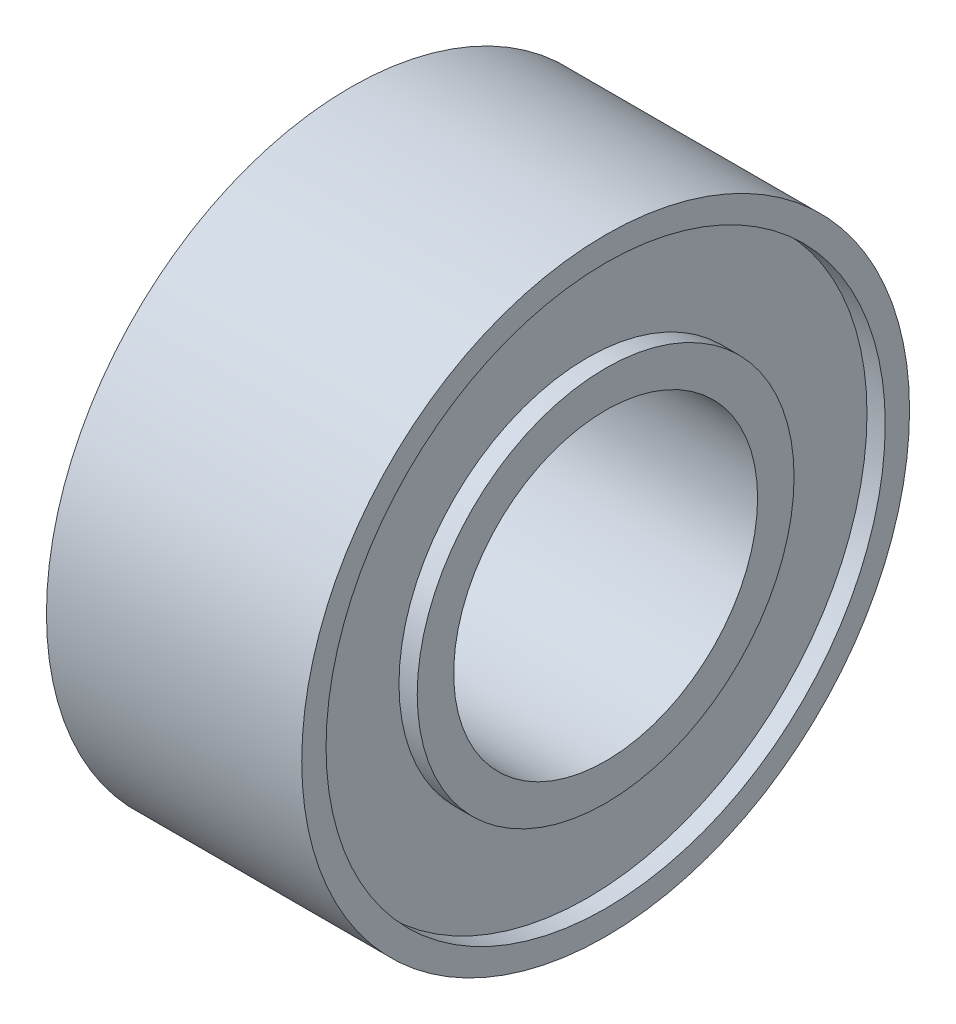
ISO-10303-21;
HEADER;
FILE_DESCRIPTION(('STEP AP214'),'2;1');
FILE_NAME('part.step','',(''),(''),'','','');
FILE_SCHEMA(('AUTOMOTIVE_DESIGN { 1 0 10303 214 1 1 1 1 }'));
ENDSEC;
DATA;
#1=APPLICATION_CONTEXT('core data for automotive mechanical design processes');
#2=APPLICATION_PROTOCOL_DEFINITION('international standard','automotive_design',2000,#1);
#3=PRODUCT_CONTEXT('',#1,'mechanical');
#4=PRODUCT('Part','Part','',(#3));
#5=PRODUCT_RELATED_PRODUCT_CATEGORY('part','',(#4));
#6=PRODUCT_DEFINITION_FORMATION('','',#4);
#7=PRODUCT_DEFINITION_CONTEXT('part definition',#1,'design');
#8=PRODUCT_DEFINITION('design','',#6,#7);
#9=PRODUCT_DEFINITION_SHAPE('','',#8);
#10=(LENGTH_UNIT() NAMED_UNIT(*) SI_UNIT(.MILLI.,.METRE.));
#11=(NAMED_UNIT(*) PLANE_ANGLE_UNIT() SI_UNIT($,.RADIAN.));
#12=(NAMED_UNIT(*) SI_UNIT($,.STERADIAN.) SOLID_ANGLE_UNIT());
#13=UNCERTAINTY_MEASURE_WITH_UNIT(LENGTH_MEASURE(1.E-05),#10,'distance_accuracy_value','');
#14=(GEOMETRIC_REPRESENTATION_CONTEXT(3) GLOBAL_UNCERTAINTY_ASSIGNED_CONTEXT((#13)) GLOBAL_UNIT_ASSIGNED_CONTEXT((#10,
#11,#12)) REPRESENTATION_CONTEXT('',''));
#15=CARTESIAN_POINT('',(0.,0.,0.));
#16=DIRECTION('',(0.,0.,1.));
#17=DIRECTION('',(1.,0.,0.));
#18=AXIS2_PLACEMENT_3D('',#15,#16,#17);
#19=CARTESIAN_POINT('',(-2.1,2.5,0.));
#20=DIRECTION('',(-1.,0.,0.));
#21=DIRECTION('',(0.,0.,1.));
#22=AXIS2_PLACEMENT_3D('',#19,#20,#21);
#23=PLANE('',#22);
#24=CARTESIAN_POINT('',(-2.1,0.,0.));
#25=DIRECTION('',(1.,0.,0.));
#26=DIRECTION('',(0.,0.,-1.));
#27=AXIS2_PLACEMENT_3D('',#24,#25,#26);
#28=CIRCLE('',#27,2.5);
#29=CARTESIAN_POINT('',(-2.1,0.,-2.5));
#30=VERTEX_POINT('',#29);
#31=EDGE_CURVE('E82',#30,#30,#28,.T.);
#32=ORIENTED_EDGE('',*,*,#31,.T.);
#33=EDGE_LOOP('',(#32));
#34=FACE_BOUND('',#33,.T.);
#35=CARTESIAN_POINT('',(-2.1,0.,0.));
#36=DIRECTION('',(1.,0.,0.));
#37=DIRECTION('',(0.,0.,-1.));
#38=AXIS2_PLACEMENT_3D('',#35,#36,#37);
#39=CIRCLE('',#38,3.1);
#40=CARTESIAN_POINT('',(-2.1,0.,-3.1));
#41=VERTEX_POINT('',#40);
#42=EDGE_CURVE('E10',#41,#41,#39,.T.);
#43=ORIENTED_EDGE('',*,*,#42,.F.);
#44=EDGE_LOOP('',(#43));
#45=FACE_BOUND('',#44,.T.);
#46=ADVANCED_FACE('F36',(#34,#45),#23,.T.);
#47=CARTESIAN_POINT('',(0.,0.,0.));
#48=DIRECTION('',(1.,0.,0.));
#49=DIRECTION('',(0.,0.,-1.));
#50=AXIS2_PLACEMENT_3D('',#47,#48,#49);
#51=CYLINDRICAL_SURFACE('',#50,3.1);
#52=ORIENTED_EDGE('',*,*,#42,.T.);
#53=EDGE_LOOP('',(#52));
#54=FACE_BOUND('',#53,.T.);
#55=CARTESIAN_POINT('',(-1.8,0.,0.));
#56=DIRECTION('',(1.,0.,0.));
#57=DIRECTION('',(0.,0.,-1.));
#58=AXIS2_PLACEMENT_3D('',#55,#56,#57);
#59=CIRCLE('',#58,3.1);
#60=CARTESIAN_POINT('',(-1.8,0.,-3.1));
#61=VERTEX_POINT('',#60);
#62=EDGE_CURVE('E42',#61,#61,#59,.T.);
#63=ORIENTED_EDGE('',*,*,#62,.F.);
#64=EDGE_LOOP('',(#63));
#65=FACE_BOUND('',#64,.T.);
#66=ADVANCED_FACE('F102',(#54,#65),#51,.T.);
#67=CARTESIAN_POINT('',(-1.8,3.1,0.));
#68=DIRECTION('',(-1.,0.,0.));
#69=DIRECTION('',(0.,0.,1.));
#70=AXIS2_PLACEMENT_3D('',#67,#68,#69);
#71=PLANE('',#70);
#72=ORIENTED_EDGE('',*,*,#62,.T.);
#73=EDGE_LOOP('',(#72));
#74=FACE_BOUND('',#73,.T.);
#75=CARTESIAN_POINT('',(-1.8,0.,0.));
#76=DIRECTION('',(1.,0.,0.));
#77=DIRECTION('',(0.,0.,-1.));
#78=AXIS2_PLACEMENT_3D('',#75,#76,#77);
#79=CIRCLE('',#78,4.6);
#80=CARTESIAN_POINT('',(-1.8,0.,-4.6));
#81=VERTEX_POINT('',#80);
#82=EDGE_CURVE('E46',#81,#81,#79,.T.);
#83=ORIENTED_EDGE('',*,*,#82,.F.);
#84=EDGE_LOOP('',(#83));
#85=FACE_BOUND('',#84,.T.);
#86=ADVANCED_FACE('F106',(#74,#85),#71,.T.);
#87=CARTESIAN_POINT('',(0.,0.,0.));
#88=DIRECTION('',(1.,0.,0.));
#89=DIRECTION('',(0.,0.,-1.));
#90=AXIS2_PLACEMENT_3D('',#87,#88,#89);
#91=CYLINDRICAL_SURFACE('',#90,4.6);
#92=ORIENTED_EDGE('',*,*,#82,.T.);
#93=EDGE_LOOP('',(#92));
#94=FACE_BOUND('',#93,.T.);
#95=CARTESIAN_POINT('',(-2.1,0.,0.));
#96=DIRECTION('',(1.,0.,0.));
#97=DIRECTION('',(0.,0.,-1.));
#98=AXIS2_PLACEMENT_3D('',#95,#96,#97);
#99=CIRCLE('',#98,4.6);
#100=CARTESIAN_POINT('',(-2.1,0.,-4.6));
#101=VERTEX_POINT('',#100);
#102=EDGE_CURVE('E51',#101,#101,#99,.T.);
#103=ORIENTED_EDGE('',*,*,#102,.F.);
#104=EDGE_LOOP('',(#103));
#105=FACE_BOUND('',#104,.T.);
#106=ADVANCED_FACE('F110',(#94,#105),#91,.F.);
#107=CARTESIAN_POINT('',(-2.1,4.6,0.));
#108=DIRECTION('',(-1.,0.,0.));
#109=DIRECTION('',(0.,0.,1.));
#110=AXIS2_PLACEMENT_3D('',#107,#108,#109);
#111=PLANE('',#110);
#112=ORIENTED_EDGE('',*,*,#102,.T.);
#113=EDGE_LOOP('',(#112));
#114=FACE_BOUND('',#113,.T.);
#115=CARTESIAN_POINT('',(-2.1,0.,0.));
#116=DIRECTION('',(1.,0.,0.));
#117=DIRECTION('',(0.,0.,-1.));
#118=AXIS2_PLACEMENT_3D('',#115,#116,#117);
#119=CIRCLE('',#118,5.);
#120=CARTESIAN_POINT('',(-2.1,0.,-5.));
#121=VERTEX_POINT('',#120);
#122=EDGE_CURVE('E57',#121,#121,#119,.T.);
#123=ORIENTED_EDGE('',*,*,#122,.F.);
#124=EDGE_LOOP('',(#123));
#125=FACE_BOUND('',#124,.T.);
#126=ADVANCED_FACE('F116',(#114,#125),#111,.T.);
#127=CARTESIAN_POINT('',(0.,0.,0.));
#128=DIRECTION('',(1.,0.,0.));
#129=DIRECTION('',(0.,0.,-1.));
#130=AXIS2_PLACEMENT_3D('',#127,#128,#129);
#131=CYLINDRICAL_SURFACE('',#130,5.);
#132=ORIENTED_EDGE('',*,*,#122,.T.);
#133=EDGE_LOOP('',(#132));
#134=FACE_BOUND('',#133,.T.);
#135=CARTESIAN_POINT('',(2.1,0.,0.));
#136=DIRECTION('',(1.,0.,0.));
#137=DIRECTION('',(0.,0.,-1.));
#138=AXIS2_PLACEMENT_3D('',#135,#136,#137);
#139=CIRCLE('',#138,5.);
#140=CARTESIAN_POINT('',(2.1,0.,-5.));
#141=VERTEX_POINT('',#140);
#142=EDGE_CURVE('E61',#141,#141,#139,.T.);
#143=ORIENTED_EDGE('',*,*,#142,.F.);
#144=EDGE_LOOP('',(#143));
#145=FACE_BOUND('',#144,.T.);
#146=ADVANCED_FACE('F120',(#134,#145),#131,.T.);
#147=CARTESIAN_POINT('',(2.1,4.6,0.));
#148=DIRECTION('',(1.,0.,0.));
#149=DIRECTION('',(0.,0.,-1.));
#150=AXIS2_PLACEMENT_3D('',#147,#148,#149);
#151=PLANE('',#150);
#152=ORIENTED_EDGE('',*,*,#142,.T.);
#153=EDGE_LOOP('',(#152));
#154=FACE_BOUND('',#153,.T.);
#155=CARTESIAN_POINT('',(2.1,0.,0.));
#156=DIRECTION('',(1.,0.,0.));
#157=DIRECTION('',(0.,0.,-1.));
#158=AXIS2_PLACEMENT_3D('',#155,#156,#157);
#159=CIRCLE('',#158,4.6);
#160=CARTESIAN_POINT('',(2.1,0.,-4.6));
#161=VERTEX_POINT('',#160);
#162=EDGE_CURVE('E65',#161,#161,#159,.T.);
#163=ORIENTED_EDGE('',*,*,#162,.F.);
#164=EDGE_LOOP('',(#163));
#165=FACE_BOUND('',#164,.T.);
#166=ADVANCED_FACE('F124',(#154,#165),#151,.T.);
#167=CARTESIAN_POINT('',(0.,0.,0.));
#168=DIRECTION('',(1.,0.,0.));
#169=DIRECTION('',(0.,0.,-1.));
#170=AXIS2_PLACEMENT_3D('',#167,#168,#169);
#171=CYLINDRICAL_SURFACE('',#170,4.6);
#172=ORIENTED_EDGE('',*,*,#162,.T.);
#173=EDGE_LOOP('',(#172));
#174=FACE_BOUND('',#173,.T.);
#175=CARTESIAN_POINT('',(1.8,0.,0.));
#176=DIRECTION('',(1.,0.,0.));
#177=DIRECTION('',(0.,0.,-1.));
#178=AXIS2_PLACEMENT_3D('',#175,#176,#177);
#179=CIRCLE('',#178,4.6);
#180=CARTESIAN_POINT('',(1.8,0.,-4.6));
#181=VERTEX_POINT('',#180);
#182=EDGE_CURVE('E69',#181,#181,#179,.T.);
#183=ORIENTED_EDGE('',*,*,#182,.F.);
#184=EDGE_LOOP('',(#183));
#185=FACE_BOUND('',#184,.T.);
#186=ADVANCED_FACE('F128',(#174,#185),#171,.F.);
#187=CARTESIAN_POINT('',(1.8,3.1,0.));
#188=DIRECTION('',(1.,0.,0.));
#189=DIRECTION('',(0.,0.,-1.));
#190=AXIS2_PLACEMENT_3D('',#187,#188,#189);
#191=PLANE('',#190);
#192=ORIENTED_EDGE('',*,*,#182,.T.);
#193=EDGE_LOOP('',(#192));
#194=FACE_BOUND('',#193,.T.);
#195=CARTESIAN_POINT('',(1.8,0.,0.));
#196=DIRECTION('',(1.,0.,0.));
#197=DIRECTION('',(0.,0.,-1.));
#198=AXIS2_PLACEMENT_3D('',#195,#196,#197);
#199=CIRCLE('',#198,3.1);
#200=CARTESIAN_POINT('',(1.8,0.,-3.1));
#201=VERTEX_POINT('',#200);
#202=EDGE_CURVE('E73',#201,#201,#199,.T.);
#203=ORIENTED_EDGE('',*,*,#202,.F.);
#204=EDGE_LOOP('',(#203));
#205=FACE_BOUND('',#204,.T.);
#206=ADVANCED_FACE('F132',(#194,#205),#191,.T.);
#207=CARTESIAN_POINT('',(0.,0.,0.));
#208=DIRECTION('',(1.,0.,0.));
#209=DIRECTION('',(0.,0.,-1.));
#210=AXIS2_PLACEMENT_3D('',#207,#208,#209);
#211=CYLINDRICAL_SURFACE('',#210,3.1);
#212=ORIENTED_EDGE('',*,*,#202,.T.);
#213=EDGE_LOOP('',(#212));
#214=FACE_BOUND('',#213,.T.);
#215=CARTESIAN_POINT('',(2.1,0.,0.));
#216=DIRECTION('',(1.,0.,0.));
#217=DIRECTION('',(0.,0.,-1.));
#218=AXIS2_PLACEMENT_3D('',#215,#216,#217);
#219=CIRCLE('',#218,3.1);
#220=CARTESIAN_POINT('',(2.1,0.,-3.1));
#221=VERTEX_POINT('',#220);
#222=EDGE_CURVE('E76',#221,#221,#219,.T.);
#223=ORIENTED_EDGE('',*,*,#222,.F.);
#224=EDGE_LOOP('',(#223));
#225=FACE_BOUND('',#224,.T.);
#226=ADVANCED_FACE('F98',(#214,#225),#211,.T.);
#227=CARTESIAN_POINT('',(2.1,2.5,0.));
#228=DIRECTION('',(1.,0.,0.));
#229=DIRECTION('',(0.,0.,-1.));
#230=AXIS2_PLACEMENT_3D('',#227,#228,#229);
#231=PLANE('',#230);
#232=ORIENTED_EDGE('',*,*,#222,.T.);
#233=EDGE_LOOP('',(#232));
#234=FACE_BOUND('',#233,.T.);
#235=CARTESIAN_POINT('',(2.1,0.,0.));
#236=DIRECTION('',(1.,0.,0.));
#237=DIRECTION('',(0.,0.,-1.));
#238=AXIS2_PLACEMENT_3D('',#235,#236,#237);
#239=CIRCLE('',#238,2.5);
#240=CARTESIAN_POINT('',(2.1,0.,-2.5));
#241=VERTEX_POINT('',#240);
#242=EDGE_CURVE('E79',#241,#241,#239,.T.);
#243=ORIENTED_EDGE('',*,*,#242,.F.);
#244=EDGE_LOOP('',(#243));
#245=FACE_BOUND('',#244,.T.);
#246=ADVANCED_FACE('F92',(#234,#245),#231,.T.);
#247=CARTESIAN_POINT('',(0.,0.,0.));
#248=DIRECTION('',(1.,0.,0.));
#249=DIRECTION('',(0.,0.,-1.));
#250=AXIS2_PLACEMENT_3D('',#247,#248,#249);
#251=CYLINDRICAL_SURFACE('',#250,2.5);
#252=ORIENTED_EDGE('',*,*,#242,.T.);
#253=EDGE_LOOP('',(#252));
#254=FACE_BOUND('',#253,.T.);
#255=ORIENTED_EDGE('',*,*,#31,.F.);
#256=EDGE_LOOP('',(#255));
#257=FACE_BOUND('',#256,.T.);
#258=ADVANCED_FACE('F90',(#254,#257),#251,.F.);
#259=CLOSED_SHELL('',(#46,#66,#86,#106,#126,#146,#166,#186,#206,#226,#246,#258));
#260=MANIFOLD_SOLID_BREP('B2',#259);
#261=ADVANCED_BREP_SHAPE_REPRESENTATION('',(#18,#260),#14);
#262=SHAPE_DEFINITION_REPRESENTATION(#9,#261);
ENDSEC;
END-ISO-10303-21;
